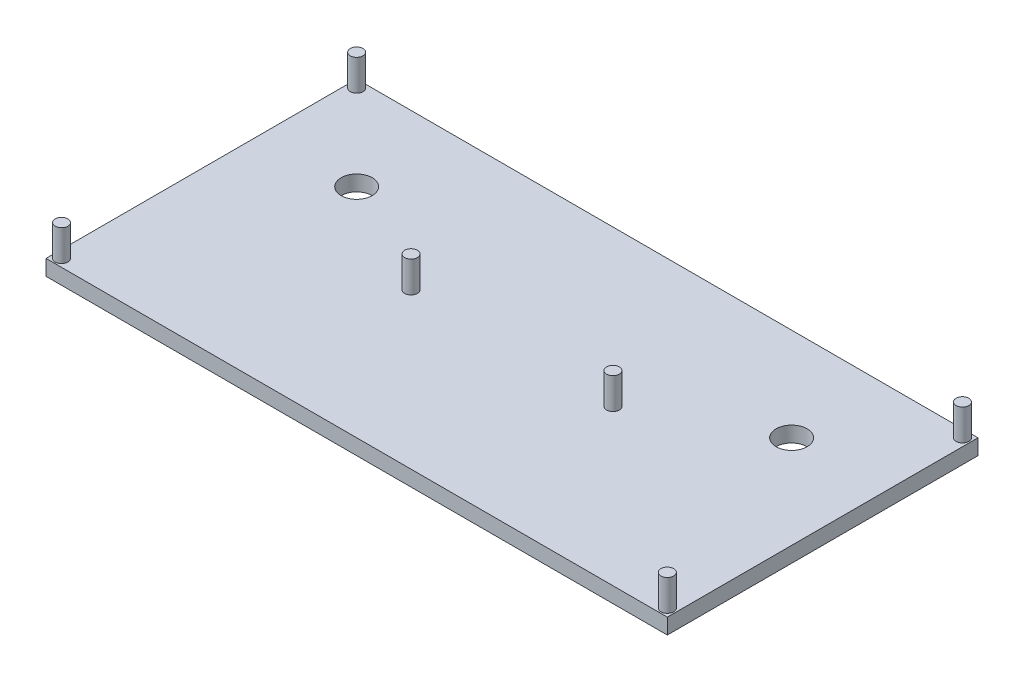
ISO-10303-21;
HEADER;
FILE_DESCRIPTION(('STEP AP214'),'2;1');
FILE_NAME('part.step','',(''),(''),'','','');
FILE_SCHEMA(('AUTOMOTIVE_DESIGN { 1 0 10303 214 1 1 1 1 }'));
ENDSEC;
DATA;
#1=APPLICATION_CONTEXT('core data for automotive mechanical design processes');
#2=APPLICATION_PROTOCOL_DEFINITION('international standard','automotive_design',2000,#1);
#3=PRODUCT_CONTEXT('',#1,'mechanical');
#4=PRODUCT('Part','Part','',(#3));
#5=PRODUCT_RELATED_PRODUCT_CATEGORY('part','',(#4));
#6=PRODUCT_DEFINITION_FORMATION('','',#4);
#7=PRODUCT_DEFINITION_CONTEXT('part definition',#1,'design');
#8=PRODUCT_DEFINITION('design','',#6,#7);
#9=PRODUCT_DEFINITION_SHAPE('','',#8);
#10=(LENGTH_UNIT() NAMED_UNIT(*) SI_UNIT(.MILLI.,.METRE.));
#11=(NAMED_UNIT(*) PLANE_ANGLE_UNIT() SI_UNIT($,.RADIAN.));
#12=(NAMED_UNIT(*) SI_UNIT($,.STERADIAN.) SOLID_ANGLE_UNIT());
#13=UNCERTAINTY_MEASURE_WITH_UNIT(LENGTH_MEASURE(1.E-05),#10,'distance_accuracy_value','');
#14=(GEOMETRIC_REPRESENTATION_CONTEXT(3) GLOBAL_UNCERTAINTY_ASSIGNED_CONTEXT((#13)) GLOBAL_UNIT_ASSIGNED_CONTEXT((#10,
#11,#12)) REPRESENTATION_CONTEXT('',''));
#15=CARTESIAN_POINT('',(0.,0.,0.));
#16=DIRECTION('',(0.,0.,1.));
#17=DIRECTION('',(1.,0.,0.));
#18=AXIS2_PLACEMENT_3D('',#15,#16,#17);
#19=CARTESIAN_POINT('',(0.,5.,0.));
#20=DIRECTION('',(1.,0.,0.));
#21=DIRECTION('',(0.,0.,-1.));
#22=AXIS2_PLACEMENT_3D('',#19,#20,#21);
#23=PLANE('',#22);
#24=DIRECTION('',(0.,0.,1.));
#25=VECTOR('',#24,1.);
#26=CARTESIAN_POINT('',(0.,0.,0.));
#27=LINE('',#26,#25);
#28=CARTESIAN_POINT('',(0.,0.,-100.));
#29=VERTEX_POINT('',#28);
#30=CARTESIAN_POINT('',(0.,0.,0.));
#31=VERTEX_POINT('',#30);
#32=EDGE_CURVE('E111',#29,#31,#27,.T.);
#33=ORIENTED_EDGE('',*,*,#32,.T.);
#34=DIRECTION('',(0.,-1.,0.));
#35=VECTOR('',#34,1.);
#36=CARTESIAN_POINT('',(0.,5.,0.));
#37=LINE('',#36,#35);
#38=CARTESIAN_POINT('',(0.,5.,0.));
#39=VERTEX_POINT('',#38);
#40=EDGE_CURVE('E100',#39,#31,#37,.T.);
#41=ORIENTED_EDGE('',*,*,#40,.F.);
#42=DIRECTION('',(0.,0.,1.));
#43=VECTOR('',#42,1.);
#44=CARTESIAN_POINT('',(0.,5.,0.));
#45=LINE('',#44,#43);
#46=CARTESIAN_POINT('',(0.,5.,-100.));
#47=VERTEX_POINT('',#46);
#48=EDGE_CURVE('E92',#47,#39,#45,.T.);
#49=ORIENTED_EDGE('',*,*,#48,.F.);
#50=DIRECTION('',(0.,-1.,0.));
#51=VECTOR('',#50,1.);
#52=CARTESIAN_POINT('',(0.,5.,-100.));
#53=LINE('',#52,#51);
#54=EDGE_CURVE('E107',#47,#29,#53,.T.);
#55=ORIENTED_EDGE('',*,*,#54,.T.);
#56=EDGE_LOOP('',(#33,#41,#49,#55));
#57=FACE_BOUND('',#56,.T.);
#58=ADVANCED_FACE('F39',(#57),#23,.F.);
#59=CARTESIAN_POINT('',(0.,5.,0.));
#60=DIRECTION('',(0.,0.,-1.));
#61=DIRECTION('',(-1.,0.,0.));
#62=AXIS2_PLACEMENT_3D('',#59,#60,#61);
#63=PLANE('',#62);
#64=DIRECTION('',(1.,0.,0.));
#65=VECTOR('',#64,1.);
#66=CARTESIAN_POINT('',(0.,0.,0.));
#67=LINE('',#66,#65);
#68=CARTESIAN_POINT('',(200.,0.,0.));
#69=VERTEX_POINT('',#68);
#70=EDGE_CURVE('E98',#31,#69,#67,.T.);
#71=ORIENTED_EDGE('',*,*,#70,.T.);
#72=DIRECTION('',(0.,-1.,0.));
#73=VECTOR('',#72,1.);
#74=CARTESIAN_POINT('',(200.,5.,0.));
#75=LINE('',#74,#73);
#76=CARTESIAN_POINT('',(200.,5.,0.));
#77=VERTEX_POINT('',#76);
#78=EDGE_CURVE('E96',#77,#69,#75,.T.);
#79=ORIENTED_EDGE('',*,*,#78,.F.);
#80=DIRECTION('',(1.,0.,0.));
#81=VECTOR('',#80,1.);
#82=CARTESIAN_POINT('',(0.,5.,0.));
#83=LINE('',#82,#81);
#84=EDGE_CURVE('E87',#39,#77,#83,.T.);
#85=ORIENTED_EDGE('',*,*,#84,.F.);
#86=ORIENTED_EDGE('',*,*,#40,.T.);
#87=EDGE_LOOP('',(#71,#79,#85,#86));
#88=FACE_BOUND('',#87,.T.);
#89=ADVANCED_FACE('F97',(#88),#63,.F.);
#90=CARTESIAN_POINT('',(200.,5.,0.));
#91=DIRECTION('',(-1.,0.,0.));
#92=DIRECTION('',(0.,0.,1.));
#93=AXIS2_PLACEMENT_3D('',#90,#91,#92);
#94=PLANE('',#93);
#95=DIRECTION('',(0.,0.,-1.));
#96=VECTOR('',#95,1.);
#97=CARTESIAN_POINT('',(200.,0.,0.));
#98=LINE('',#97,#96);
#99=CARTESIAN_POINT('',(200.,0.,-100.));
#100=VERTEX_POINT('',#99);
#101=EDGE_CURVE('E73',#69,#100,#98,.T.);
#102=ORIENTED_EDGE('',*,*,#101,.T.);
#103=DIRECTION('',(0.,-1.,0.));
#104=VECTOR('',#103,1.);
#105=CARTESIAN_POINT('',(200.,5.,-100.));
#106=LINE('',#105,#104);
#107=CARTESIAN_POINT('',(200.,5.,-100.));
#108=VERTEX_POINT('',#107);
#109=EDGE_CURVE('E101',#108,#100,#106,.T.);
#110=ORIENTED_EDGE('',*,*,#109,.F.);
#111=DIRECTION('',(0.,0.,-1.));
#112=VECTOR('',#111,1.);
#113=CARTESIAN_POINT('',(200.,5.,0.));
#114=LINE('',#113,#112);
#115=EDGE_CURVE('E90',#77,#108,#114,.T.);
#116=ORIENTED_EDGE('',*,*,#115,.F.);
#117=ORIENTED_EDGE('',*,*,#78,.T.);
#118=EDGE_LOOP('',(#102,#110,#116,#117));
#119=FACE_BOUND('',#118,.T.);
#120=ADVANCED_FACE('F103',(#119),#94,.F.);
#121=CARTESIAN_POINT('',(0.,5.,-100.));
#122=DIRECTION('',(0.,0.,1.));
#123=DIRECTION('',(1.,0.,0.));
#124=AXIS2_PLACEMENT_3D('',#121,#122,#123);
#125=PLANE('',#124);
#126=DIRECTION('',(-1.,0.,0.));
#127=VECTOR('',#126,1.);
#128=CARTESIAN_POINT('',(0.,0.,-100.));
#129=LINE('',#128,#127);
#130=EDGE_CURVE('E79',#100,#29,#129,.T.);
#131=ORIENTED_EDGE('',*,*,#130,.T.);
#132=ORIENTED_EDGE('',*,*,#54,.F.);
#133=DIRECTION('',(-1.,0.,0.));
#134=VECTOR('',#133,1.);
#135=CARTESIAN_POINT('',(0.,5.,-100.));
#136=LINE('',#135,#134);
#137=EDGE_CURVE('E56',#108,#47,#136,.T.);
#138=ORIENTED_EDGE('',*,*,#137,.F.);
#139=ORIENTED_EDGE('',*,*,#109,.T.);
#140=EDGE_LOOP('',(#131,#132,#138,#139));
#141=FACE_BOUND('',#140,.T.);
#142=ADVANCED_FACE('F152',(#141),#125,.F.);
#143=CARTESIAN_POINT('',(0.,5.,0.));
#144=DIRECTION('',(0.,-1.,0.));
#145=DIRECTION('',(0.,0.,-1.));
#146=AXIS2_PLACEMENT_3D('',#143,#144,#145);
#147=PLANE('',#146);
#148=CARTESIAN_POINT('',(170.,5.,-70.));
#149=DIRECTION('',(0.,-1.,0.));
#150=DIRECTION('',(0.,0.,-1.));
#151=AXIS2_PLACEMENT_3D('',#148,#149,#150);
#152=CIRCLE('',#151,5.00000000000002);
#153=CARTESIAN_POINT('',(170.,5.,-75.));
#154=VERTEX_POINT('',#153);
#155=EDGE_CURVE('E355',#154,#154,#152,.T.);
#156=ORIENTED_EDGE('',*,*,#155,.T.);
#157=EDGE_LOOP('',(#156));
#158=FACE_BOUND('',#157,.T.);
#159=CARTESIAN_POINT('',(29.9999999999999,5.,-69.9999999999999));
#160=DIRECTION('',(0.,-1.,0.));
#161=DIRECTION('',(0.,0.,-1.));
#162=AXIS2_PLACEMENT_3D('',#159,#160,#161);
#163=CIRCLE('',#162,5.00000000000002);
#164=CARTESIAN_POINT('',(29.9999999999999,5.,-74.9999999999999));
#165=VERTEX_POINT('',#164);
#166=EDGE_CURVE('E358',#165,#165,#163,.T.);
#167=ORIENTED_EDGE('',*,*,#166,.T.);
#168=EDGE_LOOP('',(#167));
#169=FACE_BOUND('',#168,.T.);
#170=CARTESIAN_POINT('',(132.5,5.,-50.));
#171=DIRECTION('',(0.,-1.,0.));
#172=DIRECTION('',(0.,0.,-1.));
#173=AXIS2_PLACEMENT_3D('',#170,#171,#172);
#174=CIRCLE('',#173,2.04999999999999);
#175=CARTESIAN_POINT('',(132.5,5.,-52.05));
#176=VERTEX_POINT('',#175);
#177=EDGE_CURVE('E11',#176,#176,#174,.F.);
#178=ORIENTED_EDGE('',*,*,#177,.F.);
#179=EDGE_LOOP('',(#178));
#180=FACE_BOUND('',#179,.T.);
#181=CARTESIAN_POINT('',(67.5,5.,-50.));
#182=DIRECTION('',(0.,-1.,0.));
#183=DIRECTION('',(0.,0.,-1.));
#184=AXIS2_PLACEMENT_3D('',#181,#182,#183);
#185=CIRCLE('',#184,2.04999999999999);
#186=CARTESIAN_POINT('',(67.5,5.,-52.05));
#187=VERTEX_POINT('',#186);
#188=EDGE_CURVE('E48',#187,#187,#185,.F.);
#189=ORIENTED_EDGE('',*,*,#188,.F.);
#190=EDGE_LOOP('',(#189));
#191=FACE_BOUND('',#190,.T.);
#192=CARTESIAN_POINT('',(2.5,5.,-2.50000000000004));
#193=DIRECTION('',(0.,-1.,0.));
#194=DIRECTION('',(0.,0.,-1.));
#195=AXIS2_PLACEMENT_3D('',#192,#193,#194);
#196=CIRCLE('',#195,2.05);
#197=CARTESIAN_POINT('',(2.5,5.,-4.55000000000004));
#198=VERTEX_POINT('',#197);
#199=EDGE_CURVE('E140',#198,#198,#196,.F.);
#200=ORIENTED_EDGE('',*,*,#199,.F.);
#201=EDGE_LOOP('',(#200));
#202=FACE_BOUND('',#201,.T.);
#203=CARTESIAN_POINT('',(197.5,5.,-2.49999999999993));
#204=DIRECTION('',(0.,-1.,0.));
#205=DIRECTION('',(0.,0.,-1.));
#206=AXIS2_PLACEMENT_3D('',#203,#204,#205);
#207=CIRCLE('',#206,2.04999999999999);
#208=CARTESIAN_POINT('',(197.5,5.,-4.54999999999993));
#209=VERTEX_POINT('',#208);
#210=EDGE_CURVE('E136',#209,#209,#207,.F.);
#211=ORIENTED_EDGE('',*,*,#210,.F.);
#212=EDGE_LOOP('',(#211));
#213=FACE_BOUND('',#212,.T.);
#214=CARTESIAN_POINT('',(197.5,5.,-97.5000000000001));
#215=DIRECTION('',(0.,-1.,0.));
#216=DIRECTION('',(0.,0.,-1.));
#217=AXIS2_PLACEMENT_3D('',#214,#215,#216);
#218=CIRCLE('',#217,2.04999999999999);
#219=CARTESIAN_POINT('',(197.5,5.,-99.5500000000001));
#220=VERTEX_POINT('',#219);
#221=EDGE_CURVE('E132',#220,#220,#218,.F.);
#222=ORIENTED_EDGE('',*,*,#221,.F.);
#223=EDGE_LOOP('',(#222));
#224=FACE_BOUND('',#223,.T.);
#225=CARTESIAN_POINT('',(2.5,5.,-97.5));
#226=DIRECTION('',(0.,-1.,0.));
#227=DIRECTION('',(0.,0.,-1.));
#228=AXIS2_PLACEMENT_3D('',#225,#226,#227);
#229=CIRCLE('',#228,2.05);
#230=CARTESIAN_POINT('',(2.5,5.,-99.55));
#231=VERTEX_POINT('',#230);
#232=EDGE_CURVE('E128',#231,#231,#229,.F.);
#233=ORIENTED_EDGE('',*,*,#232,.F.);
#234=EDGE_LOOP('',(#233));
#235=FACE_BOUND('',#234,.T.);
#236=ORIENTED_EDGE('',*,*,#48,.T.);
#237=ORIENTED_EDGE('',*,*,#84,.T.);
#238=ORIENTED_EDGE('',*,*,#115,.T.);
#239=ORIENTED_EDGE('',*,*,#137,.T.);
#240=EDGE_LOOP('',(#236,#237,#238,#239));
#241=FACE_BOUND('',#240,.T.);
#242=ADVANCED_FACE('F88',(#158,#169,#180,#191,#202,#213,#224,#235,#241),#147,.F.);
#243=CARTESIAN_POINT('',(0.,0.,0.));
#244=DIRECTION('',(0.,-1.,0.));
#245=DIRECTION('',(0.,0.,-1.));
#246=AXIS2_PLACEMENT_3D('',#243,#244,#245);
#247=PLANE('',#246);
#248=CARTESIAN_POINT('',(170.,0.,-70.));
#249=DIRECTION('',(0.,-1.,0.));
#250=DIRECTION('',(0.,0.,-1.));
#251=AXIS2_PLACEMENT_3D('',#248,#249,#250);
#252=CIRCLE('',#251,5.00000000000002);
#253=CARTESIAN_POINT('',(170.,0.,-75.));
#254=VERTEX_POINT('',#253);
#255=EDGE_CURVE('E352',#254,#254,#252,.T.);
#256=ORIENTED_EDGE('',*,*,#255,.F.);
#257=EDGE_LOOP('',(#256));
#258=FACE_BOUND('',#257,.T.);
#259=CARTESIAN_POINT('',(29.9999999999999,0.,-69.9999999999999));
#260=DIRECTION('',(0.,-1.,0.));
#261=DIRECTION('',(0.,0.,1.));
#262=AXIS2_PLACEMENT_3D('',#259,#260,#261);
#263=CIRCLE('',#262,5.00000000000002);
#264=CARTESIAN_POINT('',(29.9999999999999,0.,-64.9999999999999));
#265=VERTEX_POINT('',#264);
#266=EDGE_CURVE('E394',#265,#265,#263,.T.);
#267=ORIENTED_EDGE('',*,*,#266,.F.);
#268=EDGE_LOOP('',(#267));
#269=FACE_BOUND('',#268,.T.);
#270=ORIENTED_EDGE('',*,*,#32,.F.);
#271=ORIENTED_EDGE('',*,*,#130,.F.);
#272=ORIENTED_EDGE('',*,*,#101,.F.);
#273=ORIENTED_EDGE('',*,*,#70,.F.);
#274=EDGE_LOOP('',(#270,#271,#272,#273));
#275=FACE_BOUND('',#274,.T.);
#276=ADVANCED_FACE('F151',(#258,#269,#275),#247,.T.);
#277=CARTESIAN_POINT('',(2.5,15.,-97.5));
#278=DIRECTION('',(0.,-1.,0.));
#279=DIRECTION('',(0.,0.,-1.));
#280=AXIS2_PLACEMENT_3D('',#277,#278,#279);
#281=CYLINDRICAL_SURFACE('',#280,2.05);
#282=CARTESIAN_POINT('',(2.5,15.,-97.5));
#283=DIRECTION('',(0.,1.,0.));
#284=DIRECTION('',(0.,0.,1.));
#285=AXIS2_PLACEMENT_3D('',#282,#283,#284);
#286=CIRCLE('',#285,2.05);
#287=CARTESIAN_POINT('',(2.5,15.,-95.45));
#288=VERTEX_POINT('',#287);
#289=EDGE_CURVE('E115',#288,#288,#286,.T.);
#290=ORIENTED_EDGE('',*,*,#289,.F.);
#291=EDGE_LOOP('',(#290));
#292=FACE_BOUND('',#291,.T.);
#293=ORIENTED_EDGE('',*,*,#232,.T.);
#294=EDGE_LOOP('',(#293));
#295=FACE_BOUND('',#294,.T.);
#296=ADVANCED_FACE('F163',(#292,#295),#281,.T.);
#297=CARTESIAN_POINT('',(2.5,15.,-97.5));
#298=DIRECTION('',(0.,1.,0.));
#299=DIRECTION('',(0.,0.,1.));
#300=AXIS2_PLACEMENT_3D('',#297,#298,#299);
#301=PLANE('',#300);
#302=ORIENTED_EDGE('',*,*,#289,.T.);
#303=EDGE_LOOP('',(#302));
#304=FACE_BOUND('',#303,.T.);
#305=ADVANCED_FACE('F165',(#304),#301,.T.);
#306=CARTESIAN_POINT('',(197.5,15.,-97.5000000000001));
#307=DIRECTION('',(0.,-1.,0.));
#308=DIRECTION('',(0.,0.,-1.));
#309=AXIS2_PLACEMENT_3D('',#306,#307,#308);
#310=CYLINDRICAL_SURFACE('',#309,2.04999999999999);
#311=CARTESIAN_POINT('',(197.5,15.,-97.5000000000001));
#312=DIRECTION('',(0.,1.,0.));
#313=DIRECTION('',(0.,0.,-1.));
#314=AXIS2_PLACEMENT_3D('',#311,#312,#313);
#315=CIRCLE('',#314,2.04999999999999);
#316=CARTESIAN_POINT('',(197.5,15.,-99.5500000000001));
#317=VERTEX_POINT('',#316);
#318=EDGE_CURVE('E380',#317,#317,#315,.T.);
#319=ORIENTED_EDGE('',*,*,#318,.F.);
#320=EDGE_LOOP('',(#319));
#321=FACE_BOUND('',#320,.T.);
#322=ORIENTED_EDGE('',*,*,#221,.T.);
#323=EDGE_LOOP('',(#322));
#324=FACE_BOUND('',#323,.T.);
#325=ADVANCED_FACE('F172',(#321,#324),#310,.T.);
#326=CARTESIAN_POINT('',(197.5,15.,-97.5000000000001));
#327=DIRECTION('',(0.,-1.,0.));
#328=DIRECTION('',(0.,0.,-1.));
#329=AXIS2_PLACEMENT_3D('',#326,#327,#328);
#330=PLANE('',#329);
#331=ORIENTED_EDGE('',*,*,#318,.T.);
#332=EDGE_LOOP('',(#331));
#333=FACE_BOUND('',#332,.T.);
#334=ADVANCED_FACE('F238',(#333),#330,.F.);
#335=CARTESIAN_POINT('',(197.5,15.,-2.49999999999993));
#336=DIRECTION('',(0.,-1.,0.));
#337=DIRECTION('',(0.,0.,-1.));
#338=AXIS2_PLACEMENT_3D('',#335,#336,#337);
#339=CYLINDRICAL_SURFACE('',#338,2.04999999999999);
#340=CARTESIAN_POINT('',(197.5,15.,-2.49999999999993));
#341=DIRECTION('',(0.,1.,0.));
#342=DIRECTION('',(0.,0.,1.));
#343=AXIS2_PLACEMENT_3D('',#340,#341,#342);
#344=CIRCLE('',#343,2.04999999999999);
#345=CARTESIAN_POINT('',(197.5,15.,-0.44999999999994));
#346=VERTEX_POINT('',#345);
#347=EDGE_CURVE('E376',#346,#346,#344,.T.);
#348=ORIENTED_EDGE('',*,*,#347,.F.);
#349=EDGE_LOOP('',(#348));
#350=FACE_BOUND('',#349,.T.);
#351=ORIENTED_EDGE('',*,*,#210,.T.);
#352=EDGE_LOOP('',(#351));
#353=FACE_BOUND('',#352,.T.);
#354=ADVANCED_FACE('F247',(#350,#353),#339,.T.);
#355=CARTESIAN_POINT('',(197.5,15.,-2.49999999999993));
#356=DIRECTION('',(0.,1.,0.));
#357=DIRECTION('',(0.,0.,1.));
#358=AXIS2_PLACEMENT_3D('',#355,#356,#357);
#359=PLANE('',#358);
#360=ORIENTED_EDGE('',*,*,#347,.T.);
#361=EDGE_LOOP('',(#360));
#362=FACE_BOUND('',#361,.T.);
#363=ADVANCED_FACE('F256',(#362),#359,.T.);
#364=CARTESIAN_POINT('',(2.5,15.,-2.50000000000004));
#365=DIRECTION('',(0.,-1.,0.));
#366=DIRECTION('',(0.,0.,-1.));
#367=AXIS2_PLACEMENT_3D('',#364,#365,#366);
#368=CYLINDRICAL_SURFACE('',#367,2.05);
#369=CARTESIAN_POINT('',(2.5,15.,-2.50000000000004));
#370=DIRECTION('',(0.,1.,0.));
#371=DIRECTION('',(0.,0.,-1.));
#372=AXIS2_PLACEMENT_3D('',#369,#370,#371);
#373=CIRCLE('',#372,2.05);
#374=CARTESIAN_POINT('',(2.5,15.,-4.55000000000004));
#375=VERTEX_POINT('',#374);
#376=EDGE_CURVE('E372',#375,#375,#373,.T.);
#377=ORIENTED_EDGE('',*,*,#376,.F.);
#378=EDGE_LOOP('',(#377));
#379=FACE_BOUND('',#378,.T.);
#380=ORIENTED_EDGE('',*,*,#199,.T.);
#381=EDGE_LOOP('',(#380));
#382=FACE_BOUND('',#381,.T.);
#383=ADVANCED_FACE('F265',(#379,#382),#368,.T.);
#384=CARTESIAN_POINT('',(2.5,15.,-2.50000000000004));
#385=DIRECTION('',(0.,-1.,0.));
#386=DIRECTION('',(0.,0.,-1.));
#387=AXIS2_PLACEMENT_3D('',#384,#385,#386);
#388=PLANE('',#387);
#389=ORIENTED_EDGE('',*,*,#376,.T.);
#390=EDGE_LOOP('',(#389));
#391=FACE_BOUND('',#390,.T.);
#392=ADVANCED_FACE('F274',(#391),#388,.F.);
#393=CARTESIAN_POINT('',(67.5,15.,-50.));
#394=DIRECTION('',(0.,-1.,0.));
#395=DIRECTION('',(0.,0.,-1.));
#396=AXIS2_PLACEMENT_3D('',#393,#394,#395);
#397=CYLINDRICAL_SURFACE('',#396,2.04999999999999);
#398=CARTESIAN_POINT('',(67.5,15.,-50.));
#399=DIRECTION('',(0.,1.,0.));
#400=DIRECTION('',(0.,0.,1.));
#401=AXIS2_PLACEMENT_3D('',#398,#399,#400);
#402=CIRCLE('',#401,2.04999999999999);
#403=CARTESIAN_POINT('',(67.5,15.,-47.95));
#404=VERTEX_POINT('',#403);
#405=EDGE_CURVE('E363',#404,#404,#402,.T.);
#406=ORIENTED_EDGE('',*,*,#405,.F.);
#407=EDGE_LOOP('',(#406));
#408=FACE_BOUND('',#407,.T.);
#409=ORIENTED_EDGE('',*,*,#188,.T.);
#410=EDGE_LOOP('',(#409));
#411=FACE_BOUND('',#410,.T.);
#412=ADVANCED_FACE('F147',(#408,#411),#397,.T.);
#413=CARTESIAN_POINT('',(67.5,15.,-50.));
#414=DIRECTION('',(0.,1.,0.));
#415=DIRECTION('',(0.,0.,1.));
#416=AXIS2_PLACEMENT_3D('',#413,#414,#415);
#417=PLANE('',#416);
#418=ORIENTED_EDGE('',*,*,#405,.T.);
#419=EDGE_LOOP('',(#418));
#420=FACE_BOUND('',#419,.T.);
#421=ADVANCED_FACE('F291',(#420),#417,.T.);
#422=CARTESIAN_POINT('',(132.5,15.,-50.));
#423=DIRECTION('',(0.,-1.,0.));
#424=DIRECTION('',(0.,0.,-1.));
#425=AXIS2_PLACEMENT_3D('',#422,#423,#424);
#426=CYLINDRICAL_SURFACE('',#425,2.04999999999999);
#427=CARTESIAN_POINT('',(132.5,15.,-50.));
#428=DIRECTION('',(0.,1.,0.));
#429=DIRECTION('',(0.,0.,-1.));
#430=AXIS2_PLACEMENT_3D('',#427,#428,#429);
#431=CIRCLE('',#430,2.04999999999999);
#432=CARTESIAN_POINT('',(132.5,15.,-52.05));
#433=VERTEX_POINT('',#432);
#434=EDGE_CURVE('E357',#433,#433,#431,.T.);
#435=ORIENTED_EDGE('',*,*,#434,.F.);
#436=EDGE_LOOP('',(#435));
#437=FACE_BOUND('',#436,.T.);
#438=ORIENTED_EDGE('',*,*,#177,.T.);
#439=EDGE_LOOP('',(#438));
#440=FACE_BOUND('',#439,.T.);
#441=ADVANCED_FACE('F300',(#437,#440),#426,.T.);
#442=CARTESIAN_POINT('',(132.5,15.,-50.));
#443=DIRECTION('',(0.,-1.,0.));
#444=DIRECTION('',(0.,0.,-1.));
#445=AXIS2_PLACEMENT_3D('',#442,#443,#444);
#446=PLANE('',#445);
#447=ORIENTED_EDGE('',*,*,#434,.T.);
#448=EDGE_LOOP('',(#447));
#449=FACE_BOUND('',#448,.T.);
#450=ADVANCED_FACE('F309',(#449),#446,.F.);
#451=CARTESIAN_POINT('',(29.9999999999999,10.,-69.9999999999999));
#452=DIRECTION('',(0.,-1.,0.));
#453=DIRECTION('',(0.,0.,-1.));
#454=AXIS2_PLACEMENT_3D('',#451,#452,#453);
#455=CYLINDRICAL_SURFACE('',#454,5.00000000000002);
#456=ORIENTED_EDGE('',*,*,#266,.T.);
#457=EDGE_LOOP('',(#456));
#458=FACE_BOUND('',#457,.T.);
#459=ORIENTED_EDGE('',*,*,#166,.F.);
#460=EDGE_LOOP('',(#459));
#461=FACE_BOUND('',#460,.T.);
#462=ADVANCED_FACE('F317',(#458,#461),#455,.F.);
#463=CARTESIAN_POINT('',(170.,10.,-70.));
#464=DIRECTION('',(0.,-1.,0.));
#465=DIRECTION('',(0.,0.,-1.));
#466=AXIS2_PLACEMENT_3D('',#463,#464,#465);
#467=CYLINDRICAL_SURFACE('',#466,5.00000000000002);
#468=ORIENTED_EDGE('',*,*,#255,.T.);
#469=EDGE_LOOP('',(#468));
#470=FACE_BOUND('',#469,.T.);
#471=ORIENTED_EDGE('',*,*,#155,.F.);
#472=EDGE_LOOP('',(#471));
#473=FACE_BOUND('',#472,.T.);
#474=ADVANCED_FACE('F325',(#470,#473),#467,.F.);
#475=CLOSED_SHELL('',(#58,#89,#120,#142,#242,#276,#296,#305,#325,#334,#354,#363,#383,#392,#412,
#421,#441,#450,#462,#474));
#476=MANIFOLD_SOLID_BREP('B2',#475);
#477=ADVANCED_BREP_SHAPE_REPRESENTATION('',(#18,#476),#14);
#478=SHAPE_DEFINITION_REPRESENTATION(#9,#477);
ENDSEC;
END-ISO-10303-21;
